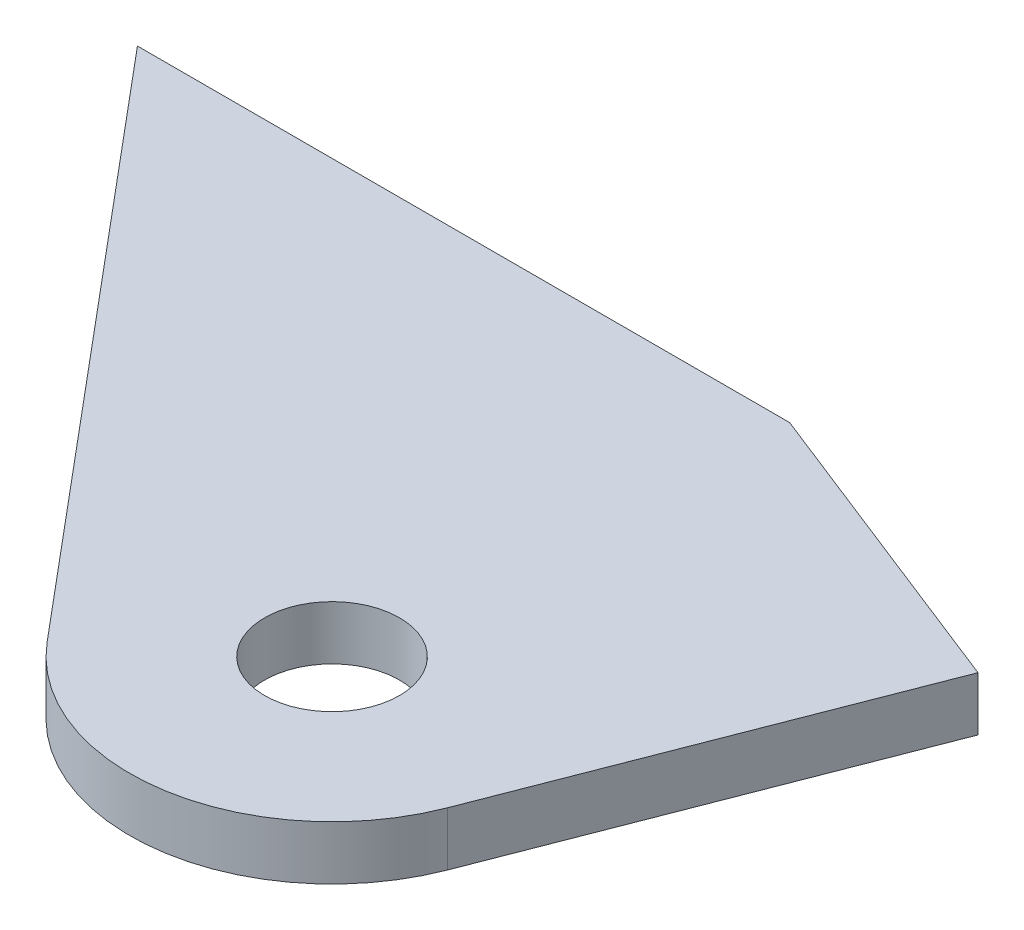
ISO-10303-21;
HEADER;
FILE_DESCRIPTION(('STEP AP214'),'2;1');
FILE_NAME('part.step','',(''),(''),'','','');
FILE_SCHEMA(('AUTOMOTIVE_DESIGN { 1 0 10303 214 1 1 1 1 }'));
ENDSEC;
DATA;
#1=APPLICATION_CONTEXT('core data for automotive mechanical design processes');
#2=APPLICATION_PROTOCOL_DEFINITION('international standard','automotive_design',2000,#1);
#3=PRODUCT_CONTEXT('',#1,'mechanical');
#4=PRODUCT('Part','Part','',(#3));
#5=PRODUCT_RELATED_PRODUCT_CATEGORY('part','',(#4));
#6=PRODUCT_DEFINITION_FORMATION('','',#4);
#7=PRODUCT_DEFINITION_CONTEXT('part definition',#1,'design');
#8=PRODUCT_DEFINITION('design','',#6,#7);
#9=PRODUCT_DEFINITION_SHAPE('','',#8);
#10=(LENGTH_UNIT() NAMED_UNIT(*) SI_UNIT(.MILLI.,.METRE.));
#11=(NAMED_UNIT(*) PLANE_ANGLE_UNIT() SI_UNIT($,.RADIAN.));
#12=(NAMED_UNIT(*) SI_UNIT($,.STERADIAN.) SOLID_ANGLE_UNIT());
#13=UNCERTAINTY_MEASURE_WITH_UNIT(LENGTH_MEASURE(1.E-05),#10,'distance_accuracy_value','');
#14=(GEOMETRIC_REPRESENTATION_CONTEXT(3) GLOBAL_UNCERTAINTY_ASSIGNED_CONTEXT((#13)) GLOBAL_UNIT_ASSIGNED_CONTEXT((#10,
#11,#12)) REPRESENTATION_CONTEXT('',''));
#15=CARTESIAN_POINT('',(0.,0.,0.));
#16=DIRECTION('',(0.,0.,1.));
#17=DIRECTION('',(1.,0.,0.));
#18=AXIS2_PLACEMENT_3D('',#15,#16,#17);
#19=CARTESIAN_POINT('',(-1156.55395395393,354.33,-448.561226059291));
#20=DIRECTION('',(0.932333717976393,0.,0.361599002106362));
#21=DIRECTION('',(0.361599002106362,0.,-0.932333717976393));
#22=AXIS2_PLACEMENT_3D('',#19,#20,#21);
#23=PLANE('',#22);
#24=DIRECTION('',(-0.361599002106362,0.,0.932333717976393));
#25=VECTOR('',#24,1.);
#26=CARTESIAN_POINT('',(-1156.55395395393,351.79,-448.561226059291));
#27=LINE('',#26,#25);
#28=CARTESIAN_POINT('',(-1393.83831133163,351.79,163.244132481267));
#29=VERTEX_POINT('',#28);
#30=CARTESIAN_POINT('',(-1400.81952133628,351.79,181.244230495063));
#31=VERTEX_POINT('',#30);
#32=EDGE_CURVE('E115',#29,#31,#27,.T.);
#33=ORIENTED_EDGE('',*,*,#32,.F.);
#34=DIRECTION('',(0.,-1.,0.));
#35=VECTOR('',#34,1.);
#36=CARTESIAN_POINT('',(-1393.83831133163,354.33,163.244132481267));
#37=LINE('',#36,#35);
#38=CARTESIAN_POINT('',(-1393.83831133163,354.33,163.244132481267));
#39=VERTEX_POINT('',#38);
#40=EDGE_CURVE('E11',#39,#29,#37,.T.);
#41=ORIENTED_EDGE('',*,*,#40,.F.);
#42=DIRECTION('',(-0.361599002106362,0.,0.932333717976393));
#43=VECTOR('',#42,1.);
#44=CARTESIAN_POINT('',(-1156.55395395393,354.33,-448.561226059291));
#45=LINE('',#44,#43);
#46=CARTESIAN_POINT('',(-1400.81952133628,354.33,181.244230495063));
#47=VERTEX_POINT('',#46);
#48=EDGE_CURVE('E128',#39,#47,#45,.T.);
#49=ORIENTED_EDGE('',*,*,#48,.T.);
#50=DIRECTION('',(0.,-1.,0.));
#51=VECTOR('',#50,1.);
#52=CARTESIAN_POINT('',(-1400.81952133628,354.33,181.244230495063));
#53=LINE('',#52,#51);
#54=EDGE_CURVE('E40',#47,#31,#53,.T.);
#55=ORIENTED_EDGE('',*,*,#54,.T.);
#56=EDGE_LOOP('',(#33,#41,#49,#55));
#57=FACE_BOUND('',#56,.T.);
#58=ADVANCED_FACE('F36',(#57),#23,.T.);
#59=CARTESIAN_POINT('',(-242.899359318571,354.33,616.621594984492));
#60=DIRECTION('',(0.366508611464744,0.,-0.930414659021549));
#61=DIRECTION('',(-0.93041465902155,0.,-0.366508611464745));
#62=AXIS2_PLACEMENT_3D('',#59,#60,#61);
#63=PLANE('',#62);
#64=DIRECTION('',(0.93041465902155,0.,0.366508611464745));
#65=VECTOR('',#64,1.);
#66=CARTESIAN_POINT('',(-242.899359318571,351.79,616.621594984492));
#67=LINE('',#66,#65);
#68=CARTESIAN_POINT('',(-1408.47107353517,351.79,157.48));
#69=VERTEX_POINT('',#68);
#70=EDGE_CURVE('E124',#69,#29,#67,.T.);
#71=ORIENTED_EDGE('',*,*,#70,.F.);
#72=DIRECTION('',(0.,-1.,0.));
#73=VECTOR('',#72,1.);
#74=CARTESIAN_POINT('',(-1408.47107353517,354.33,157.48));
#75=LINE('',#74,#73);
#76=CARTESIAN_POINT('',(-1408.47107353517,354.33,157.48));
#77=VERTEX_POINT('',#76);
#78=EDGE_CURVE('E46',#77,#69,#75,.T.);
#79=ORIENTED_EDGE('',*,*,#78,.F.);
#80=DIRECTION('',(0.93041465902155,0.,0.366508611464745));
#81=VECTOR('',#80,1.);
#82=CARTESIAN_POINT('',(-242.899359318571,354.33,616.621594984492));
#83=LINE('',#82,#81);
#84=EDGE_CURVE('E107',#77,#39,#83,.T.);
#85=ORIENTED_EDGE('',*,*,#84,.T.);
#86=ORIENTED_EDGE('',*,*,#40,.T.);
#87=EDGE_LOOP('',(#71,#79,#85,#86));
#88=FACE_BOUND('',#87,.T.);
#89=ADVANCED_FACE('F132',(#88),#63,.T.);
#90=CARTESIAN_POINT('',(1.33226762955019E-12,354.33,157.48));
#91=DIRECTION('',(0.,0.,-1.));
#92=DIRECTION('',(0.,1.,0.));
#93=AXIS2_PLACEMENT_3D('',#90,#91,#92);
#94=PLANE('',#93);
#95=DIRECTION('',(1.,0.,0.));
#96=VECTOR('',#95,1.);
#97=CARTESIAN_POINT('',(1.33226762955019E-12,351.79,157.48));
#98=LINE('',#97,#96);
#99=CARTESIAN_POINT('',(-1439.18450893641,351.79,157.48));
#100=VERTEX_POINT('',#99);
#101=EDGE_CURVE('E94',#100,#69,#98,.T.);
#102=ORIENTED_EDGE('',*,*,#101,.F.);
#103=DIRECTION('',(0.,-1.,0.));
#104=VECTOR('',#103,1.);
#105=CARTESIAN_POINT('',(-1439.18450893641,354.33,157.48));
#106=LINE('',#105,#104);
#107=CARTESIAN_POINT('',(-1439.18450893641,354.33,157.48));
#108=VERTEX_POINT('',#107);
#109=EDGE_CURVE('E88',#108,#100,#106,.T.);
#110=ORIENTED_EDGE('',*,*,#109,.F.);
#111=DIRECTION('',(1.,0.,0.));
#112=VECTOR('',#111,1.);
#113=CARTESIAN_POINT('',(1.33226762955019E-12,354.33,157.48));
#114=LINE('',#113,#112);
#115=EDGE_CURVE('E92',#108,#77,#114,.T.);
#116=ORIENTED_EDGE('',*,*,#115,.T.);
#117=ORIENTED_EDGE('',*,*,#78,.T.);
#118=EDGE_LOOP('',(#102,#110,#116,#117));
#119=FACE_BOUND('',#118,.T.);
#120=ADVANCED_FACE('F90',(#119),#94,.T.);
#121=CARTESIAN_POINT('',(-922.09190059204,354.33,773.726973698326));
#122=DIRECTION('',(0.766044443118984,0.,-0.642787609686534));
#123=DIRECTION('',(-0.642787609686534,0.,-0.766044443118983));
#124=AXIS2_PLACEMENT_3D('',#121,#122,#123);
#125=PLANE('',#124);
#126=DIRECTION('',(0.642787609686534,0.,0.766044443118984));
#127=VECTOR('',#126,1.);
#128=CARTESIAN_POINT('',(-922.09190059204,351.79,773.726973698326));
#129=LINE('',#128,#127);
#130=CARTESIAN_POINT('',(-1416.99657332071,351.79,183.922551982264));
#131=VERTEX_POINT('',#130);
#132=EDGE_CURVE('E121',#100,#131,#129,.T.);
#133=ORIENTED_EDGE('',*,*,#132,.T.);
#134=DIRECTION('',(0.,-1.,0.));
#135=VECTOR('',#134,1.);
#136=CARTESIAN_POINT('',(-1416.99657332071,354.33,183.922551982264));
#137=LINE('',#136,#135);
#138=CARTESIAN_POINT('',(-1416.99657332071,354.33,183.922551982264));
#139=VERTEX_POINT('',#138);
#140=EDGE_CURVE('E98',#139,#131,#137,.T.);
#141=ORIENTED_EDGE('',*,*,#140,.F.);
#142=DIRECTION('',(0.642787609686534,0.,0.766044443118984));
#143=VECTOR('',#142,1.);
#144=CARTESIAN_POINT('',(-922.09190059204,354.33,773.726973698326));
#145=LINE('',#144,#143);
#146=EDGE_CURVE('E101',#108,#139,#145,.T.);
#147=ORIENTED_EDGE('',*,*,#146,.F.);
#148=ORIENTED_EDGE('',*,*,#109,.T.);
#149=EDGE_LOOP('',(#133,#141,#147,#148));
#150=FACE_BOUND('',#149,.T.);
#151=ADVANCED_FACE('F102',(#150),#125,.F.);
#152=CARTESIAN_POINT('',(-1409.7,354.33,177.8));
#153=DIRECTION('',(0.,-1.,0.));
#154=DIRECTION('',(1.,0.,0.));
#155=AXIS2_PLACEMENT_3D('',#152,#153,#154);
#156=CYLINDRICAL_SURFACE('',#155,3.17499999999986);
#157=CARTESIAN_POINT('',(-1409.7,354.33,177.8));
#158=DIRECTION('',(0.,-1.,0.));
#159=DIRECTION('',(1.,0.,0.));
#160=AXIS2_PLACEMENT_3D('',#157,#158,#159);
#161=CIRCLE('',#160,3.17499999999986);
#162=CARTESIAN_POINT('',(-1406.525,354.33,177.8));
#163=VERTEX_POINT('',#162);
#164=EDGE_CURVE('E126',#163,#163,#161,.T.);
#165=ORIENTED_EDGE('',*,*,#164,.F.);
#166=EDGE_LOOP('',(#165));
#167=FACE_BOUND('',#166,.T.);
#168=CARTESIAN_POINT('',(-1409.7,351.79,177.8));
#169=DIRECTION('',(0.,-1.,0.));
#170=DIRECTION('',(1.,0.,0.));
#171=AXIS2_PLACEMENT_3D('',#168,#169,#170);
#172=CIRCLE('',#171,3.17499999999986);
#173=CARTESIAN_POINT('',(-1406.525,351.79,177.8));
#174=VERTEX_POINT('',#173);
#175=EDGE_CURVE('E112',#174,#174,#172,.T.);
#176=ORIENTED_EDGE('',*,*,#175,.T.);
#177=EDGE_LOOP('',(#176));
#178=FACE_BOUND('',#177,.T.);
#179=ADVANCED_FACE('F38',(#167,#178),#156,.F.);
#180=CARTESIAN_POINT('',(-1409.7,354.33,177.8));
#181=DIRECTION('',(0.,-1.,0.));
#182=DIRECTION('',(1.,0.,0.));
#183=AXIS2_PLACEMENT_3D('',#180,#181,#182);
#184=CYLINDRICAL_SURFACE('',#183,9.52499999999993);
#185=CARTESIAN_POINT('',(-1409.7,351.79,177.8));
#186=DIRECTION('',(0.,-1.,0.));
#187=DIRECTION('',(1.,0.,0.));
#188=AXIS2_PLACEMENT_3D('',#185,#186,#187);
#189=CIRCLE('',#188,9.52499999999993);
#190=EDGE_CURVE('E118',#31,#131,#189,.T.);
#191=ORIENTED_EDGE('',*,*,#190,.F.);
#192=ORIENTED_EDGE('',*,*,#54,.F.);
#193=CARTESIAN_POINT('',(-1409.7,354.33,177.8));
#194=DIRECTION('',(0.,-1.,0.));
#195=DIRECTION('',(1.,0.,0.));
#196=AXIS2_PLACEMENT_3D('',#193,#194,#195);
#197=CIRCLE('',#196,9.52499999999993);
#198=EDGE_CURVE('E104',#47,#139,#197,.T.);
#199=ORIENTED_EDGE('',*,*,#198,.T.);
#200=ORIENTED_EDGE('',*,*,#140,.T.);
#201=EDGE_LOOP('',(#191,#192,#199,#200));
#202=FACE_BOUND('',#201,.T.);
#203=ADVANCED_FACE('F129',(#202),#184,.T.);
#204=CARTESIAN_POINT('',(1.11022302462516E-12,354.33,4.71844785465692E-13));
#205=DIRECTION('',(0.,-1.,0.));
#206=DIRECTION('',(1.,0.,0.));
#207=AXIS2_PLACEMENT_3D('',#204,#205,#206);
#208=PLANE('',#207);
#209=ORIENTED_EDGE('',*,*,#164,.T.);
#210=EDGE_LOOP('',(#209));
#211=FACE_BOUND('',#210,.T.);
#212=ORIENTED_EDGE('',*,*,#48,.F.);
#213=ORIENTED_EDGE('',*,*,#84,.F.);
#214=ORIENTED_EDGE('',*,*,#115,.F.);
#215=ORIENTED_EDGE('',*,*,#146,.T.);
#216=ORIENTED_EDGE('',*,*,#198,.F.);
#217=EDGE_LOOP('',(#212,#213,#214,#215,#216));
#218=FACE_BOUND('',#217,.T.);
#219=ADVANCED_FACE('F106',(#211,#218),#208,.F.);
#220=CARTESIAN_POINT('',(1.11022302462516E-12,351.79,4.71844785465692E-13));
#221=DIRECTION('',(0.,-1.,0.));
#222=DIRECTION('',(1.,0.,0.));
#223=AXIS2_PLACEMENT_3D('',#220,#221,#222);
#224=PLANE('',#223);
#225=ORIENTED_EDGE('',*,*,#175,.F.);
#226=EDGE_LOOP('',(#225));
#227=FACE_BOUND('',#226,.T.);
#228=ORIENTED_EDGE('',*,*,#32,.T.);
#229=ORIENTED_EDGE('',*,*,#190,.T.);
#230=ORIENTED_EDGE('',*,*,#132,.F.);
#231=ORIENTED_EDGE('',*,*,#101,.T.);
#232=ORIENTED_EDGE('',*,*,#70,.T.);
#233=EDGE_LOOP('',(#228,#229,#230,#231,#232));
#234=FACE_BOUND('',#233,.T.);
#235=ADVANCED_FACE('F131',(#227,#234),#224,.T.);
#236=CLOSED_SHELL('',(#58,#89,#120,#151,#179,#203,#219,#235));
#237=MANIFOLD_SOLID_BREP('B2',#236);
#238=ADVANCED_BREP_SHAPE_REPRESENTATION('',(#18,#237),#14);
#239=SHAPE_DEFINITION_REPRESENTATION(#9,#238);
ENDSEC;
END-ISO-10303-21;
